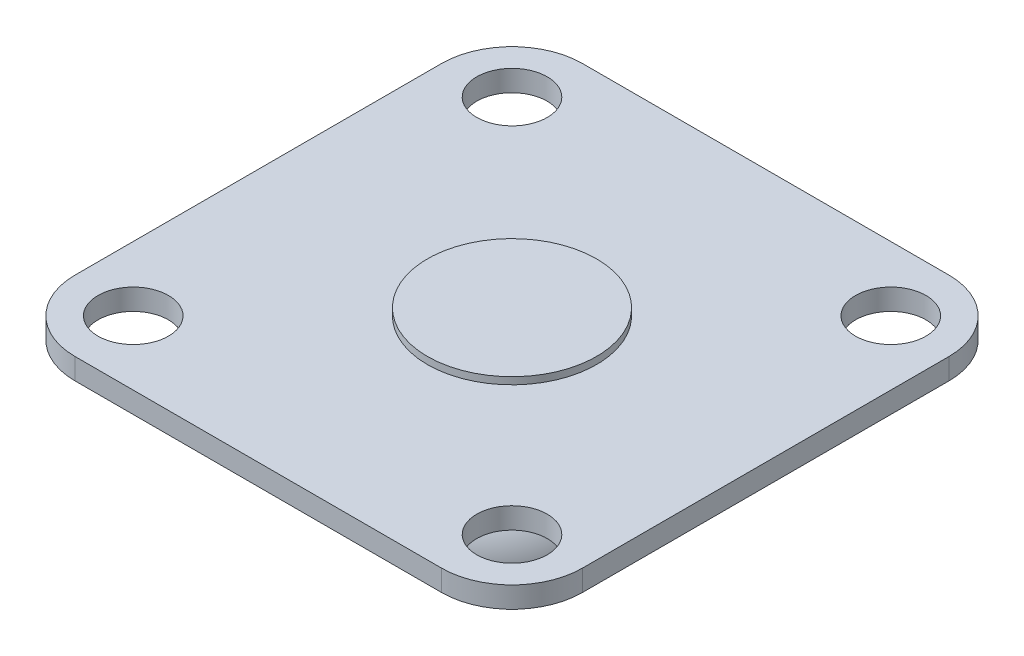
ISO-10303-21;
HEADER;
FILE_DESCRIPTION(('STEP AP214'),'2;1');
FILE_NAME('part.step','',(''),(''),'','','');
FILE_SCHEMA(('AUTOMOTIVE_DESIGN { 1 0 10303 214 1 1 1 1 }'));
ENDSEC;
DATA;
#1=APPLICATION_CONTEXT('core data for automotive mechanical design processes');
#2=APPLICATION_PROTOCOL_DEFINITION('international standard','automotive_design',2000,#1);
#3=PRODUCT_CONTEXT('',#1,'mechanical');
#4=PRODUCT('Part','Part','',(#3));
#5=PRODUCT_RELATED_PRODUCT_CATEGORY('part','',(#4));
#6=PRODUCT_DEFINITION_FORMATION('','',#4);
#7=PRODUCT_DEFINITION_CONTEXT('part definition',#1,'design');
#8=PRODUCT_DEFINITION('design','',#6,#7);
#9=PRODUCT_DEFINITION_SHAPE('','',#8);
#10=(LENGTH_UNIT() NAMED_UNIT(*) SI_UNIT(.MILLI.,.METRE.));
#11=(NAMED_UNIT(*) PLANE_ANGLE_UNIT() SI_UNIT($,.RADIAN.));
#12=(NAMED_UNIT(*) SI_UNIT($,.STERADIAN.) SOLID_ANGLE_UNIT());
#13=UNCERTAINTY_MEASURE_WITH_UNIT(LENGTH_MEASURE(1.E-05),#10,'distance_accuracy_value','');
#14=(GEOMETRIC_REPRESENTATION_CONTEXT(3) GLOBAL_UNCERTAINTY_ASSIGNED_CONTEXT((#13)) GLOBAL_UNIT_ASSIGNED_CONTEXT((#10,
#11,#12)) REPRESENTATION_CONTEXT('',''));
#15=CARTESIAN_POINT('',(0.,0.,0.));
#16=DIRECTION('',(0.,0.,1.));
#17=DIRECTION('',(1.,0.,0.));
#18=AXIS2_PLACEMENT_3D('',#15,#16,#17);
#19=CARTESIAN_POINT('',(0.,2.,0.));
#20=DIRECTION('',(0.,-1.,0.));
#21=DIRECTION('',(0.,0.,-1.));
#22=AXIS2_PLACEMENT_3D('',#19,#20,#21);
#23=CYLINDRICAL_SURFACE('',#22,6.);
#24=CARTESIAN_POINT('',(0.,0.,0.));
#25=DIRECTION('',(0.,1.,0.));
#26=DIRECTION('',(0.,0.,1.));
#27=AXIS2_PLACEMENT_3D('',#24,#25,#26);
#28=CIRCLE('',#27,6.);
#29=CARTESIAN_POINT('',(0.,0.,6.));
#30=VERTEX_POINT('',#29);
#31=EDGE_CURVE('E268',#30,#30,#28,.T.);
#32=ORIENTED_EDGE('',*,*,#31,.F.);
#33=EDGE_LOOP('',(#32));
#34=FACE_BOUND('',#33,.T.);
#35=CARTESIAN_POINT('',(0.,-3.,0.));
#36=DIRECTION('',(0.,-1.,0.));
#37=DIRECTION('',(0.,0.,-1.));
#38=AXIS2_PLACEMENT_3D('',#35,#36,#37);
#39=CIRCLE('',#38,6.);
#40=CARTESIAN_POINT('',(0.,-3.,-6.));
#41=VERTEX_POINT('',#40);
#42=EDGE_CURVE('E279',#41,#41,#39,.T.);
#43=ORIENTED_EDGE('',*,*,#42,.F.);
#44=EDGE_LOOP('',(#43));
#45=FACE_BOUND('',#44,.T.);
#46=ADVANCED_FACE('F52',(#34,#45),#23,.T.);
#47=CARTESIAN_POINT('',(13.,1.5,-13.));
#48=DIRECTION('',(0.,-1.,0.));
#49=DIRECTION('',(0.,0.,-1.));
#50=AXIS2_PLACEMENT_3D('',#47,#48,#49);
#51=CYLINDRICAL_SURFACE('',#50,5.);
#52=CARTESIAN_POINT('',(13.,0.,-13.));
#53=DIRECTION('',(0.,1.,0.));
#54=DIRECTION('',(0.,0.,1.));
#55=AXIS2_PLACEMENT_3D('',#52,#53,#54);
#56=CIRCLE('',#55,5.);
#57=CARTESIAN_POINT('',(13.,0.,-18.));
#58=VERTEX_POINT('',#57);
#59=CARTESIAN_POINT('',(18.,0.,-13.));
#60=VERTEX_POINT('',#59);
#61=EDGE_CURVE('E300',#58,#60,#56,.F.);
#62=ORIENTED_EDGE('',*,*,#61,.F.);
#63=DIRECTION('',(0.,-1.,0.));
#64=VECTOR('',#63,1.);
#65=CARTESIAN_POINT('',(13.,1.5,-18.));
#66=LINE('',#65,#64);
#67=CARTESIAN_POINT('',(13.,1.5,-18.));
#68=VERTEX_POINT('',#67);
#69=EDGE_CURVE('E124',#68,#58,#66,.T.);
#70=ORIENTED_EDGE('',*,*,#69,.F.);
#71=CARTESIAN_POINT('',(13.,1.5,-13.));
#72=DIRECTION('',(0.,1.,0.));
#73=DIRECTION('',(0.,0.,1.));
#74=AXIS2_PLACEMENT_3D('',#71,#72,#73);
#75=CIRCLE('',#74,5.);
#76=CARTESIAN_POINT('',(18.,1.5,-13.));
#77=VERTEX_POINT('',#76);
#78=EDGE_CURVE('E231',#68,#77,#75,.F.);
#79=ORIENTED_EDGE('',*,*,#78,.T.);
#80=DIRECTION('',(0.,-1.,0.));
#81=VECTOR('',#80,1.);
#82=CARTESIAN_POINT('',(18.,1.5,-13.));
#83=LINE('',#82,#81);
#84=EDGE_CURVE('E120',#77,#60,#83,.T.);
#85=ORIENTED_EDGE('',*,*,#84,.T.);
#86=EDGE_LOOP('',(#62,#70,#79,#85));
#87=FACE_BOUND('',#86,.T.);
#88=ADVANCED_FACE('F365',(#87),#51,.T.);
#89=CARTESIAN_POINT('',(0.,1.5,-18.));
#90=DIRECTION('',(0.,0.,-1.));
#91=DIRECTION('',(-1.,0.,0.));
#92=AXIS2_PLACEMENT_3D('',#89,#90,#91);
#93=PLANE('',#92);
#94=DIRECTION('',(1.,0.,0.));
#95=VECTOR('',#94,1.);
#96=CARTESIAN_POINT('',(0.,0.,-18.));
#97=LINE('',#96,#95);
#98=CARTESIAN_POINT('',(-13.,0.,-18.));
#99=VERTEX_POINT('',#98);
#100=EDGE_CURVE('E307',#99,#58,#97,.T.);
#101=ORIENTED_EDGE('',*,*,#100,.F.);
#102=DIRECTION('',(0.,-1.,0.));
#103=VECTOR('',#102,1.);
#104=CARTESIAN_POINT('',(-13.,1.5,-18.));
#105=LINE('',#104,#103);
#106=CARTESIAN_POINT('',(-13.,1.5,-18.));
#107=VERTEX_POINT('',#106);
#108=EDGE_CURVE('E326',#107,#99,#105,.T.);
#109=ORIENTED_EDGE('',*,*,#108,.F.);
#110=DIRECTION('',(1.,0.,0.));
#111=VECTOR('',#110,1.);
#112=CARTESIAN_POINT('',(0.,1.5,-18.));
#113=LINE('',#112,#111);
#114=EDGE_CURVE('E225',#107,#68,#113,.T.);
#115=ORIENTED_EDGE('',*,*,#114,.T.);
#116=ORIENTED_EDGE('',*,*,#69,.T.);
#117=EDGE_LOOP('',(#101,#109,#115,#116));
#118=FACE_BOUND('',#117,.T.);
#119=ADVANCED_FACE('F370',(#118),#93,.T.);
#120=CARTESIAN_POINT('',(-13.,1.5,-13.));
#121=DIRECTION('',(0.,-1.,0.));
#122=DIRECTION('',(0.,0.,-1.));
#123=AXIS2_PLACEMENT_3D('',#120,#121,#122);
#124=CYLINDRICAL_SURFACE('',#123,5.);
#125=CARTESIAN_POINT('',(-13.,0.,-13.));
#126=DIRECTION('',(0.,1.,0.));
#127=DIRECTION('',(0.,0.,1.));
#128=AXIS2_PLACEMENT_3D('',#125,#126,#127);
#129=CIRCLE('',#128,5.);
#130=CARTESIAN_POINT('',(-18.,0.,-13.));
#131=VERTEX_POINT('',#130);
#132=EDGE_CURVE('E312',#131,#99,#129,.F.);
#133=ORIENTED_EDGE('',*,*,#132,.F.);
#134=DIRECTION('',(0.,-1.,0.));
#135=VECTOR('',#134,1.);
#136=CARTESIAN_POINT('',(-18.,1.5,-13.));
#137=LINE('',#136,#135);
#138=CARTESIAN_POINT('',(-18.,1.5,-13.));
#139=VERTEX_POINT('',#138);
#140=EDGE_CURVE('E324',#139,#131,#137,.T.);
#141=ORIENTED_EDGE('',*,*,#140,.F.);
#142=CARTESIAN_POINT('',(-13.,1.5,-13.));
#143=DIRECTION('',(0.,1.,0.));
#144=DIRECTION('',(0.,0.,1.));
#145=AXIS2_PLACEMENT_3D('',#142,#143,#144);
#146=CIRCLE('',#145,5.);
#147=EDGE_CURVE('E230',#139,#107,#146,.F.);
#148=ORIENTED_EDGE('',*,*,#147,.T.);
#149=ORIENTED_EDGE('',*,*,#108,.T.);
#150=EDGE_LOOP('',(#133,#141,#148,#149));
#151=FACE_BOUND('',#150,.T.);
#152=ADVANCED_FACE('F443',(#151),#124,.T.);
#153=CARTESIAN_POINT('',(-18.,1.5,0.));
#154=DIRECTION('',(-1.,0.,0.));
#155=DIRECTION('',(0.,0.,1.));
#156=AXIS2_PLACEMENT_3D('',#153,#154,#155);
#157=PLANE('',#156);
#158=DIRECTION('',(0.,0.,-1.));
#159=VECTOR('',#158,1.);
#160=CARTESIAN_POINT('',(-18.,0.,0.));
#161=LINE('',#160,#159);
#162=CARTESIAN_POINT('',(-18.,0.,13.));
#163=VERTEX_POINT('',#162);
#164=EDGE_CURVE('E255',#163,#131,#161,.T.);
#165=ORIENTED_EDGE('',*,*,#164,.F.);
#166=DIRECTION('',(0.,-1.,0.));
#167=VECTOR('',#166,1.);
#168=CARTESIAN_POINT('',(-18.,1.5,13.));
#169=LINE('',#168,#167);
#170=CARTESIAN_POINT('',(-18.,1.5,13.));
#171=VERTEX_POINT('',#170);
#172=EDGE_CURVE('E169',#171,#163,#169,.T.);
#173=ORIENTED_EDGE('',*,*,#172,.F.);
#174=DIRECTION('',(0.,0.,-1.));
#175=VECTOR('',#174,1.);
#176=CARTESIAN_POINT('',(-18.,1.5,0.));
#177=LINE('',#176,#175);
#178=EDGE_CURVE('E234',#171,#139,#177,.T.);
#179=ORIENTED_EDGE('',*,*,#178,.T.);
#180=ORIENTED_EDGE('',*,*,#140,.T.);
#181=EDGE_LOOP('',(#165,#173,#179,#180));
#182=FACE_BOUND('',#181,.T.);
#183=ADVANCED_FACE('F438',(#182),#157,.T.);
#184=CARTESIAN_POINT('',(-13.,1.5,13.));
#185=DIRECTION('',(0.,-1.,0.));
#186=DIRECTION('',(0.,0.,-1.));
#187=AXIS2_PLACEMENT_3D('',#184,#185,#186);
#188=CYLINDRICAL_SURFACE('',#187,5.);
#189=CARTESIAN_POINT('',(-13.,0.,13.));
#190=DIRECTION('',(0.,1.,0.));
#191=DIRECTION('',(0.,0.,1.));
#192=AXIS2_PLACEMENT_3D('',#189,#190,#191);
#193=CIRCLE('',#192,5.);
#194=CARTESIAN_POINT('',(-13.,0.,18.));
#195=VERTEX_POINT('',#194);
#196=EDGE_CURVE('E247',#195,#163,#193,.F.);
#197=ORIENTED_EDGE('',*,*,#196,.F.);
#198=DIRECTION('',(0.,-1.,0.));
#199=VECTOR('',#198,1.);
#200=CARTESIAN_POINT('',(-13.,1.5,18.));
#201=LINE('',#200,#199);
#202=CARTESIAN_POINT('',(-13.,1.5,18.));
#203=VERTEX_POINT('',#202);
#204=EDGE_CURVE('E166',#203,#195,#201,.T.);
#205=ORIENTED_EDGE('',*,*,#204,.F.);
#206=CARTESIAN_POINT('',(-13.,1.5,13.));
#207=DIRECTION('',(0.,1.,0.));
#208=DIRECTION('',(0.,0.,1.));
#209=AXIS2_PLACEMENT_3D('',#206,#207,#208);
#210=CIRCLE('',#209,5.);
#211=EDGE_CURVE('E158',#203,#171,#210,.F.);
#212=ORIENTED_EDGE('',*,*,#211,.T.);
#213=ORIENTED_EDGE('',*,*,#172,.T.);
#214=EDGE_LOOP('',(#197,#205,#212,#213));
#215=FACE_BOUND('',#214,.T.);
#216=ADVANCED_FACE('F244',(#215),#188,.T.);
#217=CARTESIAN_POINT('',(0.,1.5,18.));
#218=DIRECTION('',(0.,0.,-1.));
#219=DIRECTION('',(-1.,0.,0.));
#220=AXIS2_PLACEMENT_3D('',#217,#218,#219);
#221=PLANE('',#220);
#222=DIRECTION('',(1.,0.,0.));
#223=VECTOR('',#222,1.);
#224=CARTESIAN_POINT('',(0.,0.,18.));
#225=LINE('',#224,#223);
#226=CARTESIAN_POINT('',(13.,0.,18.));
#227=VERTEX_POINT('',#226);
#228=EDGE_CURVE('E164',#195,#227,#225,.T.);
#229=ORIENTED_EDGE('',*,*,#228,.T.);
#230=DIRECTION('',(0.,-1.,0.));
#231=VECTOR('',#230,1.);
#232=CARTESIAN_POINT('',(13.,1.5,18.));
#233=LINE('',#232,#231);
#234=CARTESIAN_POINT('',(13.,1.5,18.));
#235=VERTEX_POINT('',#234);
#236=EDGE_CURVE('E147',#235,#227,#233,.T.);
#237=ORIENTED_EDGE('',*,*,#236,.F.);
#238=DIRECTION('',(1.,0.,0.));
#239=VECTOR('',#238,1.);
#240=CARTESIAN_POINT('',(0.,1.5,18.));
#241=LINE('',#240,#239);
#242=EDGE_CURVE('E151',#203,#235,#241,.T.);
#243=ORIENTED_EDGE('',*,*,#242,.F.);
#244=ORIENTED_EDGE('',*,*,#204,.T.);
#245=EDGE_LOOP('',(#229,#237,#243,#244));
#246=FACE_BOUND('',#245,.T.);
#247=ADVANCED_FACE('F162',(#246),#221,.F.);
#248=CARTESIAN_POINT('',(13.,1.5,13.));
#249=DIRECTION('',(0.,-1.,0.));
#250=DIRECTION('',(0.,0.,-1.));
#251=AXIS2_PLACEMENT_3D('',#248,#249,#250);
#252=CYLINDRICAL_SURFACE('',#251,5.);
#253=CARTESIAN_POINT('',(13.,0.,13.));
#254=DIRECTION('',(0.,1.,0.));
#255=DIRECTION('',(0.,0.,1.));
#256=AXIS2_PLACEMENT_3D('',#253,#254,#255);
#257=CIRCLE('',#256,5.);
#258=CARTESIAN_POINT('',(18.,0.,13.));
#259=VERTEX_POINT('',#258);
#260=EDGE_CURVE('E250',#227,#259,#257,.T.);
#261=ORIENTED_EDGE('',*,*,#260,.T.);
#262=DIRECTION('',(0.,-1.,0.));
#263=VECTOR('',#262,1.);
#264=CARTESIAN_POINT('',(18.,1.5,13.));
#265=LINE('',#264,#263);
#266=CARTESIAN_POINT('',(18.,1.5,13.));
#267=VERTEX_POINT('',#266);
#268=EDGE_CURVE('E149',#267,#259,#265,.T.);
#269=ORIENTED_EDGE('',*,*,#268,.F.);
#270=CARTESIAN_POINT('',(13.,1.5,13.));
#271=DIRECTION('',(0.,1.,0.));
#272=DIRECTION('',(0.,0.,1.));
#273=AXIS2_PLACEMENT_3D('',#270,#271,#272);
#274=CIRCLE('',#273,5.);
#275=EDGE_CURVE('E142',#235,#267,#274,.T.);
#276=ORIENTED_EDGE('',*,*,#275,.F.);
#277=ORIENTED_EDGE('',*,*,#236,.T.);
#278=EDGE_LOOP('',(#261,#269,#276,#277));
#279=FACE_BOUND('',#278,.T.);
#280=ADVANCED_FACE('F145',(#279),#252,.T.);
#281=CARTESIAN_POINT('',(-13.4350288425444,1.5,13.4350288425444));
#282=DIRECTION('',(0.,-1.,0.));
#283=DIRECTION('',(0.,0.,-1.));
#284=AXIS2_PLACEMENT_3D('',#281,#282,#283);
#285=CYLINDRICAL_SURFACE('',#284,2.5);
#286=CARTESIAN_POINT('',(-13.4350288425444,1.5,13.4350288425444));
#287=DIRECTION('',(0.,1.,0.));
#288=DIRECTION('',(0.,0.,1.));
#289=AXIS2_PLACEMENT_3D('',#286,#287,#288);
#290=CIRCLE('',#289,2.5);
#291=CARTESIAN_POINT('',(-13.4350288425444,1.5,15.9350288425444));
#292=VERTEX_POINT('',#291);
#293=EDGE_CURVE('E217',#292,#292,#290,.T.);
#294=ORIENTED_EDGE('',*,*,#293,.T.);
#295=EDGE_LOOP('',(#294));
#296=FACE_BOUND('',#295,.T.);
#297=CARTESIAN_POINT('',(-13.4350288425444,0.,13.4350288425444));
#298=DIRECTION('',(0.,1.,0.));
#299=DIRECTION('',(0.,0.,1.));
#300=AXIS2_PLACEMENT_3D('',#297,#298,#299);
#301=CIRCLE('',#300,2.5);
#302=CARTESIAN_POINT('',(-13.4350288425444,0.,15.9350288425444));
#303=VERTEX_POINT('',#302);
#304=EDGE_CURVE('E293',#303,#303,#301,.T.);
#305=ORIENTED_EDGE('',*,*,#304,.F.);
#306=EDGE_LOOP('',(#305));
#307=FACE_BOUND('',#306,.T.);
#308=ADVANCED_FACE('F343',(#296,#307),#285,.F.);
#309=CARTESIAN_POINT('',(-13.4350288425444,1.5,-13.4350288425444));
#310=DIRECTION('',(0.,-1.,0.));
#311=DIRECTION('',(0.,0.,-1.));
#312=AXIS2_PLACEMENT_3D('',#309,#310,#311);
#313=CYLINDRICAL_SURFACE('',#312,2.5);
#314=CARTESIAN_POINT('',(-13.4350288425444,1.5,-13.4350288425444));
#315=DIRECTION('',(0.,1.,0.));
#316=DIRECTION('',(0.,0.,1.));
#317=AXIS2_PLACEMENT_3D('',#314,#315,#316);
#318=CIRCLE('',#317,2.5);
#319=CARTESIAN_POINT('',(-13.4350288425444,1.5,-10.9350288425444));
#320=VERTEX_POINT('',#319);
#321=EDGE_CURVE('E212',#320,#320,#318,.T.);
#322=ORIENTED_EDGE('',*,*,#321,.T.);
#323=EDGE_LOOP('',(#322));
#324=FACE_BOUND('',#323,.T.);
#325=CARTESIAN_POINT('',(-13.4350288425444,0.,-13.4350288425444));
#326=DIRECTION('',(0.,1.,0.));
#327=DIRECTION('',(0.,0.,1.));
#328=AXIS2_PLACEMENT_3D('',#325,#326,#327);
#329=CIRCLE('',#328,2.5);
#330=CARTESIAN_POINT('',(-13.4350288425444,0.,-10.9350288425444));
#331=VERTEX_POINT('',#330);
#332=EDGE_CURVE('E287',#331,#331,#329,.T.);
#333=ORIENTED_EDGE('',*,*,#332,.F.);
#334=EDGE_LOOP('',(#333));
#335=FACE_BOUND('',#334,.T.);
#336=ADVANCED_FACE('F455',(#324,#335),#313,.F.);
#337=CARTESIAN_POINT('',(13.4350288425444,1.5,13.4350288425444));
#338=DIRECTION('',(0.,-1.,0.));
#339=DIRECTION('',(0.,0.,-1.));
#340=AXIS2_PLACEMENT_3D('',#337,#338,#339);
#341=CYLINDRICAL_SURFACE('',#340,2.5);
#342=CARTESIAN_POINT('',(13.4350288425444,1.5,13.4350288425444));
#343=DIRECTION('',(0.,1.,0.));
#344=DIRECTION('',(0.,0.,1.));
#345=AXIS2_PLACEMENT_3D('',#342,#343,#344);
#346=CIRCLE('',#345,2.5);
#347=CARTESIAN_POINT('',(13.4350288425444,1.5,15.9350288425444));
#348=VERTEX_POINT('',#347);
#349=EDGE_CURVE('E205',#348,#348,#346,.T.);
#350=ORIENTED_EDGE('',*,*,#349,.T.);
#351=EDGE_LOOP('',(#350));
#352=FACE_BOUND('',#351,.T.);
#353=CARTESIAN_POINT('',(13.4350288425444,0.,13.4350288425444));
#354=DIRECTION('',(0.,1.,0.));
#355=DIRECTION('',(0.,0.,1.));
#356=AXIS2_PLACEMENT_3D('',#353,#354,#355);
#357=CIRCLE('',#356,2.5);
#358=CARTESIAN_POINT('',(13.4350288425444,0.,15.9350288425444));
#359=VERTEX_POINT('',#358);
#360=EDGE_CURVE('E294',#359,#359,#357,.T.);
#361=ORIENTED_EDGE('',*,*,#360,.F.);
#362=EDGE_LOOP('',(#361));
#363=FACE_BOUND('',#362,.T.);
#364=ADVANCED_FACE('F458',(#352,#363),#341,.F.);
#365=CARTESIAN_POINT('',(13.4350288425444,1.5,-13.4350288425444));
#366=DIRECTION('',(0.,-1.,0.));
#367=DIRECTION('',(0.,0.,-1.));
#368=AXIS2_PLACEMENT_3D('',#365,#366,#367);
#369=CYLINDRICAL_SURFACE('',#368,2.5);
#370=CARTESIAN_POINT('',(13.4350288425444,1.5,-13.4350288425444));
#371=DIRECTION('',(0.,1.,0.));
#372=DIRECTION('',(0.,0.,1.));
#373=AXIS2_PLACEMENT_3D('',#370,#371,#372);
#374=CIRCLE('',#373,2.5);
#375=CARTESIAN_POINT('',(13.4350288425444,1.5,-10.9350288425444));
#376=VERTEX_POINT('',#375);
#377=EDGE_CURVE('E200',#376,#376,#374,.T.);
#378=ORIENTED_EDGE('',*,*,#377,.T.);
#379=EDGE_LOOP('',(#378));
#380=FACE_BOUND('',#379,.T.);
#381=CARTESIAN_POINT('',(13.4350288425444,0.,-13.4350288425444));
#382=DIRECTION('',(0.,1.,0.));
#383=DIRECTION('',(0.,0.,1.));
#384=AXIS2_PLACEMENT_3D('',#381,#382,#383);
#385=CIRCLE('',#384,2.5);
#386=CARTESIAN_POINT('',(13.4350288425444,0.,-10.9350288425444));
#387=VERTEX_POINT('',#386);
#388=EDGE_CURVE('E334',#387,#387,#385,.T.);
#389=ORIENTED_EDGE('',*,*,#388,.F.);
#390=EDGE_LOOP('',(#389));
#391=FACE_BOUND('',#390,.T.);
#392=ADVANCED_FACE('F357',(#380,#391),#369,.F.);
#393=CARTESIAN_POINT('',(18.,1.5,0.));
#394=DIRECTION('',(-1.,0.,0.));
#395=DIRECTION('',(0.,0.,1.));
#396=AXIS2_PLACEMENT_3D('',#393,#394,#395);
#397=PLANE('',#396);
#398=DIRECTION('',(0.,0.,-1.));
#399=VECTOR('',#398,1.);
#400=CARTESIAN_POINT('',(18.,0.,0.));
#401=LINE('',#400,#399);
#402=EDGE_CURVE('E111',#259,#60,#401,.T.);
#403=ORIENTED_EDGE('',*,*,#402,.T.);
#404=ORIENTED_EDGE('',*,*,#84,.F.);
#405=DIRECTION('',(0.,0.,-1.));
#406=VECTOR('',#405,1.);
#407=CARTESIAN_POINT('',(18.,1.5,0.));
#408=LINE('',#407,#406);
#409=EDGE_CURVE('E74',#267,#77,#408,.T.);
#410=ORIENTED_EDGE('',*,*,#409,.F.);
#411=ORIENTED_EDGE('',*,*,#268,.T.);
#412=EDGE_LOOP('',(#403,#404,#410,#411));
#413=FACE_BOUND('',#412,.T.);
#414=ADVANCED_FACE('F347',(#413),#397,.F.);
#415=CARTESIAN_POINT('',(0.,1.5,0.));
#416=DIRECTION('',(0.,1.,0.));
#417=DIRECTION('',(0.,0.,1.));
#418=AXIS2_PLACEMENT_3D('',#415,#416,#417);
#419=PLANE('',#418);
#420=CARTESIAN_POINT('',(0.,1.5,0.));
#421=DIRECTION('',(0.,1.,0.));
#422=DIRECTION('',(0.,0.,1.));
#423=AXIS2_PLACEMENT_3D('',#420,#421,#422);
#424=CIRCLE('',#423,6.);
#425=CARTESIAN_POINT('',(0.,1.5,6.));
#426=VERTEX_POINT('',#425);
#427=EDGE_CURVE('E63',#426,#426,#424,.T.);
#428=ORIENTED_EDGE('',*,*,#427,.F.);
#429=EDGE_LOOP('',(#428));
#430=FACE_BOUND('',#429,.T.);
#431=ORIENTED_EDGE('',*,*,#377,.F.);
#432=EDGE_LOOP('',(#431));
#433=FACE_BOUND('',#432,.T.);
#434=ORIENTED_EDGE('',*,*,#349,.F.);
#435=EDGE_LOOP('',(#434));
#436=FACE_BOUND('',#435,.T.);
#437=ORIENTED_EDGE('',*,*,#321,.F.);
#438=EDGE_LOOP('',(#437));
#439=FACE_BOUND('',#438,.T.);
#440=ORIENTED_EDGE('',*,*,#293,.F.);
#441=EDGE_LOOP('',(#440));
#442=FACE_BOUND('',#441,.T.);
#443=ORIENTED_EDGE('',*,*,#78,.F.);
#444=ORIENTED_EDGE('',*,*,#114,.F.);
#445=ORIENTED_EDGE('',*,*,#147,.F.);
#446=ORIENTED_EDGE('',*,*,#178,.F.);
#447=ORIENTED_EDGE('',*,*,#211,.F.);
#448=ORIENTED_EDGE('',*,*,#242,.T.);
#449=ORIENTED_EDGE('',*,*,#275,.T.);
#450=ORIENTED_EDGE('',*,*,#409,.T.);
#451=EDGE_LOOP('',(#443,#444,#445,#446,#447,#448,#449,#450));
#452=FACE_BOUND('',#451,.T.);
#453=ADVANCED_FACE('F155',(#430,#433,#436,#439,#442,#452),#419,.T.);
#454=CARTESIAN_POINT('',(0.,0.,0.));
#455=DIRECTION('',(0.,1.,0.));
#456=DIRECTION('',(0.,0.,1.));
#457=AXIS2_PLACEMENT_3D('',#454,#455,#456);
#458=PLANE('',#457);
#459=ORIENTED_EDGE('',*,*,#31,.T.);
#460=EDGE_LOOP('',(#459));
#461=FACE_BOUND('',#460,.T.);
#462=ORIENTED_EDGE('',*,*,#388,.T.);
#463=EDGE_LOOP('',(#462));
#464=FACE_BOUND('',#463,.T.);
#465=ORIENTED_EDGE('',*,*,#360,.T.);
#466=EDGE_LOOP('',(#465));
#467=FACE_BOUND('',#466,.T.);
#468=ORIENTED_EDGE('',*,*,#332,.T.);
#469=EDGE_LOOP('',(#468));
#470=FACE_BOUND('',#469,.T.);
#471=ORIENTED_EDGE('',*,*,#304,.T.);
#472=EDGE_LOOP('',(#471));
#473=FACE_BOUND('',#472,.T.);
#474=ORIENTED_EDGE('',*,*,#61,.T.);
#475=ORIENTED_EDGE('',*,*,#402,.F.);
#476=ORIENTED_EDGE('',*,*,#260,.F.);
#477=ORIENTED_EDGE('',*,*,#228,.F.);
#478=ORIENTED_EDGE('',*,*,#196,.T.);
#479=ORIENTED_EDGE('',*,*,#164,.T.);
#480=ORIENTED_EDGE('',*,*,#132,.T.);
#481=ORIENTED_EDGE('',*,*,#100,.T.);
#482=EDGE_LOOP('',(#474,#475,#476,#477,#478,#479,#480,#481));
#483=FACE_BOUND('',#482,.T.);
#484=ADVANCED_FACE('F248',(#461,#464,#467,#470,#473,#483),#458,.F.);
#485=ORIENTED_EDGE('',*,*,#427,.T.);
#486=EDGE_LOOP('',(#485));
#487=FACE_BOUND('',#486,.T.);
#488=CARTESIAN_POINT('',(0.,2.,0.));
#489=DIRECTION('',(0.,-1.,0.));
#490=DIRECTION('',(0.,0.,-1.));
#491=AXIS2_PLACEMENT_3D('',#488,#489,#490);
#492=CIRCLE('',#491,6.);
#493=CARTESIAN_POINT('',(0.,2.,-6.));
#494=VERTEX_POINT('',#493);
#495=EDGE_CURVE('E263',#494,#494,#492,.T.);
#496=ORIENTED_EDGE('',*,*,#495,.T.);
#497=EDGE_LOOP('',(#496));
#498=FACE_BOUND('',#497,.T.);
#499=ADVANCED_FACE('F354',(#487,#498),#23,.T.);
#500=CARTESIAN_POINT('',(0.,2.,0.));
#501=DIRECTION('',(0.,-1.,0.));
#502=DIRECTION('',(0.,0.,-1.));
#503=AXIS2_PLACEMENT_3D('',#500,#501,#502);
#504=PLANE('',#503);
#505=ORIENTED_EDGE('',*,*,#495,.F.);
#506=EDGE_LOOP('',(#505));
#507=FACE_BOUND('',#506,.T.);
#508=ADVANCED_FACE('F377',(#507),#504,.F.);
#509=CARTESIAN_POINT('',(0.,-8.,0.));
#510=DIRECTION('',(0.,-1.,0.));
#511=DIRECTION('',(0.,0.,-1.));
#512=AXIS2_PLACEMENT_3D('',#509,#510,#511);
#513=PLANE('',#512);
#514=CARTESIAN_POINT('',(0.,-8.,0.));
#515=DIRECTION('',(0.,-1.,0.));
#516=DIRECTION('',(0.,0.,-1.));
#517=AXIS2_PLACEMENT_3D('',#514,#515,#516);
#518=CIRCLE('',#517,9.);
#519=CARTESIAN_POINT('',(0.,-8.,-9.));
#520=VERTEX_POINT('',#519);
#521=EDGE_CURVE('E273',#520,#520,#518,.T.);
#522=ORIENTED_EDGE('',*,*,#521,.T.);
#523=EDGE_LOOP('',(#522));
#524=FACE_BOUND('',#523,.T.);
#525=CARTESIAN_POINT('',(0.,-8.,0.));
#526=DIRECTION('',(0.,-1.,0.));
#527=DIRECTION('',(0.,0.,-1.));
#528=AXIS2_PLACEMENT_3D('',#525,#526,#527);
#529=CIRCLE('',#528,6.);
#530=CARTESIAN_POINT('',(0.,-8.,-6.));
#531=VERTEX_POINT('',#530);
#532=EDGE_CURVE('E278',#531,#531,#529,.T.);
#533=ORIENTED_EDGE('',*,*,#532,.F.);
#534=EDGE_LOOP('',(#533));
#535=FACE_BOUND('',#534,.T.);
#536=ADVANCED_FACE('F382',(#524,#535),#513,.T.);
#537=CARTESIAN_POINT('',(0.,-8.,0.));
#538=DIRECTION('',(0.,1.,0.));
#539=DIRECTION('',(0.,0.,1.));
#540=AXIS2_PLACEMENT_3D('',#537,#538,#539);
#541=CYLINDRICAL_SURFACE('',#540,9.);
#542=CARTESIAN_POINT('',(0.,-7.58257569495584,0.));
#543=DIRECTION('',(0.,1.,0.));
#544=DIRECTION('',(0.,0.,1.));
#545=AXIS2_PLACEMENT_3D('',#542,#543,#544);
#546=CIRCLE('',#545,9.);
#547=CARTESIAN_POINT('',(0.,-7.58257569495584,9.));
#548=VERTEX_POINT('',#547);
#549=EDGE_CURVE('E12',#548,#548,#546,.F.);
#550=ORIENTED_EDGE('',*,*,#549,.T.);
#551=EDGE_LOOP('',(#550));
#552=FACE_BOUND('',#551,.T.);
#553=ORIENTED_EDGE('',*,*,#521,.F.);
#554=EDGE_LOOP('',(#553));
#555=FACE_BOUND('',#554,.T.);
#556=ADVANCED_FACE('F403',(#552,#555),#541,.T.);
#557=CARTESIAN_POINT('',(0.,-8.,0.));
#558=DIRECTION('',(0.,1.,0.));
#559=DIRECTION('',(0.,0.,1.));
#560=AXIS2_PLACEMENT_3D('',#557,#558,#559);
#561=CYLINDRICAL_SURFACE('',#560,6.);
#562=CARTESIAN_POINT('',(0.,-4.,0.));
#563=DIRECTION('',(0.,-1.,0.));
#564=DIRECTION('',(0.,0.,-1.));
#565=AXIS2_PLACEMENT_3D('',#562,#563,#564);
#566=CIRCLE('',#565,6.);
#567=CARTESIAN_POINT('',(0.,-4.,-6.));
#568=VERTEX_POINT('',#567);
#569=EDGE_CURVE('E269',#568,#568,#566,.F.);
#570=ORIENTED_EDGE('',*,*,#569,.T.);
#571=EDGE_LOOP('',(#570));
#572=FACE_BOUND('',#571,.T.);
#573=ORIENTED_EDGE('',*,*,#532,.T.);
#574=EDGE_LOOP('',(#573));
#575=FACE_BOUND('',#574,.T.);
#576=ADVANCED_FACE('F406',(#572,#575),#561,.F.);
#577=CARTESIAN_POINT('',(0.,-4.,0.));
#578=DIRECTION('',(0.,-1.,0.));
#579=DIRECTION('',(0.,0.,-1.));
#580=AXIS2_PLACEMENT_3D('',#577,#578,#579);
#581=PLANE('',#580);
#582=ORIENTED_EDGE('',*,*,#569,.F.);
#583=EDGE_LOOP('',(#582));
#584=FACE_BOUND('',#583,.T.);
#585=ADVANCED_FACE('F400',(#584),#581,.T.);
#586=CARTESIAN_POINT('',(0.,-7.58257569495584,0.));
#587=DIRECTION('',(0.,1.,0.));
#588=DIRECTION('',(0.,0.,1.));
#589=AXIS2_PLACEMENT_3D('',#586,#587,#588);
#590=DEGENERATE_TOROIDAL_SURFACE('',#589,4.,5.,.T.);
#591=ORIENTED_EDGE('',*,*,#42,.T.);
#592=EDGE_LOOP('',(#591));
#593=FACE_BOUND('',#592,.T.);
#594=ORIENTED_EDGE('',*,*,#549,.F.);
#595=EDGE_LOOP('',(#594));
#596=FACE_BOUND('',#595,.T.);
#597=ADVANCED_FACE('F55',(#593,#596),#590,.T.);
#598=CLOSED_SHELL('',(#46,#88,#119,#152,#183,#216,#247,#280,#308,#336,#364,#392,#414,#453,#484,
#499,#508,#536,#556,#576,#585,#597));
#599=MANIFOLD_SOLID_BREP('B2',#598);
#600=ADVANCED_BREP_SHAPE_REPRESENTATION('',(#18,#599),#14);
#601=SHAPE_DEFINITION_REPRESENTATION(#9,#600);
ENDSEC;
END-ISO-10303-21;
